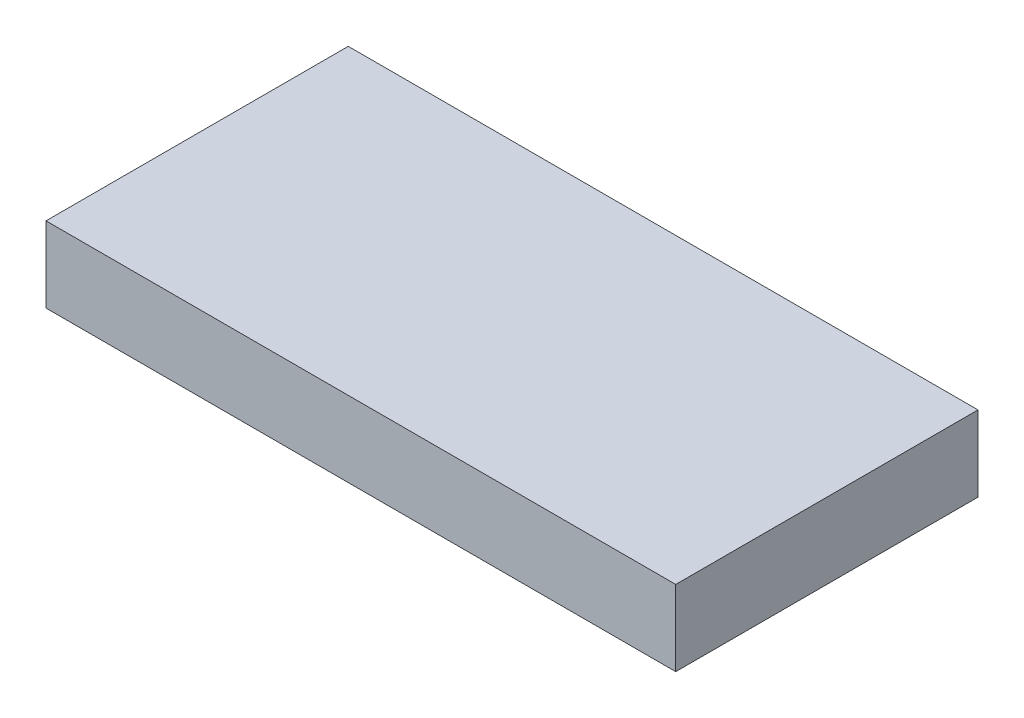
ISO-10303-21;
HEADER;
FILE_DESCRIPTION(('STEP AP214'),'2;1');
FILE_NAME('part.step','',(''),(''),'','','');
FILE_SCHEMA(('AUTOMOTIVE_DESIGN { 1 0 10303 214 1 1 1 1 }'));
ENDSEC;
DATA;
#1=APPLICATION_CONTEXT('core data for automotive mechanical design processes');
#2=APPLICATION_PROTOCOL_DEFINITION('international standard','automotive_design',2000,#1);
#3=PRODUCT_CONTEXT('',#1,'mechanical');
#4=PRODUCT('Part','Part','',(#3));
#5=PRODUCT_RELATED_PRODUCT_CATEGORY('part','',(#4));
#6=PRODUCT_DEFINITION_FORMATION('','',#4);
#7=PRODUCT_DEFINITION_CONTEXT('part definition',#1,'design');
#8=PRODUCT_DEFINITION('design','',#6,#7);
#9=PRODUCT_DEFINITION_SHAPE('','',#8);
#10=(LENGTH_UNIT() NAMED_UNIT(*) SI_UNIT(.MILLI.,.METRE.));
#11=(NAMED_UNIT(*) PLANE_ANGLE_UNIT() SI_UNIT($,.RADIAN.));
#12=(NAMED_UNIT(*) SI_UNIT($,.STERADIAN.) SOLID_ANGLE_UNIT());
#13=UNCERTAINTY_MEASURE_WITH_UNIT(LENGTH_MEASURE(1.E-05),#10,'distance_accuracy_value','');
#14=(GEOMETRIC_REPRESENTATION_CONTEXT(3) GLOBAL_UNCERTAINTY_ASSIGNED_CONTEXT((#13)) GLOBAL_UNIT_ASSIGNED_CONTEXT((#10,
#11,#12)) REPRESENTATION_CONTEXT('',''));
#15=CARTESIAN_POINT('',(0.,0.,0.));
#16=DIRECTION('',(0.,0.,1.));
#17=DIRECTION('',(1.,0.,0.));
#18=AXIS2_PLACEMENT_3D('',#15,#16,#17);
#19=CARTESIAN_POINT('',(-125.,30.,-59.9999999999998));
#20=DIRECTION('',(1.,0.,0.));
#21=DIRECTION('',(0.,0.,-1.));
#22=AXIS2_PLACEMENT_3D('',#19,#20,#21);
#23=PLANE('',#22);
#24=DIRECTION('',(0.,0.,1.));
#25=VECTOR('',#24,1.);
#26=CARTESIAN_POINT('',(-125.,0.,-59.9999999999998));
#27=LINE('',#26,#25);
#28=CARTESIAN_POINT('',(-125.,0.,-59.9999999999998));
#29=VERTEX_POINT('',#28);
#30=CARTESIAN_POINT('',(-125.,0.,60.0000000000002));
#31=VERTEX_POINT('',#30);
#32=EDGE_CURVE('E111',#29,#31,#27,.T.);
#33=ORIENTED_EDGE('',*,*,#32,.T.);
#34=DIRECTION('',(0.,-1.,0.));
#35=VECTOR('',#34,1.);
#36=CARTESIAN_POINT('',(-125.,30.,60.0000000000002));
#37=LINE('',#36,#35);
#38=CARTESIAN_POINT('',(-125.,30.,60.0000000000002));
#39=VERTEX_POINT('',#38);
#40=EDGE_CURVE('E11',#39,#31,#37,.T.);
#41=ORIENTED_EDGE('',*,*,#40,.F.);
#42=DIRECTION('',(0.,0.,1.));
#43=VECTOR('',#42,1.);
#44=CARTESIAN_POINT('',(-125.,30.,-59.9999999999998));
#45=LINE('',#44,#43);
#46=CARTESIAN_POINT('',(-125.,30.,-59.9999999999998));
#47=VERTEX_POINT('',#46);
#48=EDGE_CURVE('E95',#47,#39,#45,.T.);
#49=ORIENTED_EDGE('',*,*,#48,.F.);
#50=DIRECTION('',(0.,-1.,0.));
#51=VECTOR('',#50,1.);
#52=CARTESIAN_POINT('',(-125.,30.,-59.9999999999998));
#53=LINE('',#52,#51);
#54=EDGE_CURVE('E107',#47,#29,#53,.T.);
#55=ORIENTED_EDGE('',*,*,#54,.T.);
#56=EDGE_LOOP('',(#33,#41,#49,#55));
#57=FACE_BOUND('',#56,.T.);
#58=ADVANCED_FACE('F43',(#57),#23,.F.);
#59=CARTESIAN_POINT('',(125.,30.,60.0000000000002));
#60=DIRECTION('',(0.,0.,-1.));
#61=DIRECTION('',(-1.,0.,0.));
#62=AXIS2_PLACEMENT_3D('',#59,#60,#61);
#63=PLANE('',#62);
#64=DIRECTION('',(1.,0.,0.));
#65=VECTOR('',#64,1.);
#66=CARTESIAN_POINT('',(125.,0.,60.0000000000002));
#67=LINE('',#66,#65);
#68=CARTESIAN_POINT('',(125.,0.,60.0000000000002));
#69=VERTEX_POINT('',#68);
#70=EDGE_CURVE('E100',#31,#69,#67,.T.);
#71=ORIENTED_EDGE('',*,*,#70,.T.);
#72=DIRECTION('',(0.,-1.,0.));
#73=VECTOR('',#72,1.);
#74=CARTESIAN_POINT('',(125.,30.,60.0000000000002));
#75=LINE('',#74,#73);
#76=CARTESIAN_POINT('',(125.,30.,60.0000000000002));
#77=VERTEX_POINT('',#76);
#78=EDGE_CURVE('E52',#77,#69,#75,.T.);
#79=ORIENTED_EDGE('',*,*,#78,.F.);
#80=DIRECTION('',(1.,0.,0.));
#81=VECTOR('',#80,1.);
#82=CARTESIAN_POINT('',(125.,30.,60.0000000000002));
#83=LINE('',#82,#81);
#84=EDGE_CURVE('E90',#39,#77,#83,.T.);
#85=ORIENTED_EDGE('',*,*,#84,.F.);
#86=ORIENTED_EDGE('',*,*,#40,.T.);
#87=EDGE_LOOP('',(#71,#79,#85,#86));
#88=FACE_BOUND('',#87,.T.);
#89=ADVANCED_FACE('F99',(#88),#63,.F.);
#90=CARTESIAN_POINT('',(125.,30.,-59.9999999999998));
#91=DIRECTION('',(-1.,0.,0.));
#92=DIRECTION('',(0.,0.,1.));
#93=AXIS2_PLACEMENT_3D('',#90,#91,#92);
#94=PLANE('',#93);
#95=DIRECTION('',(0.,0.,-1.));
#96=VECTOR('',#95,1.);
#97=CARTESIAN_POINT('',(125.,0.,-59.9999999999998));
#98=LINE('',#97,#96);
#99=CARTESIAN_POINT('',(125.,0.,-59.9999999999998));
#100=VERTEX_POINT('',#99);
#101=EDGE_CURVE('E77',#69,#100,#98,.T.);
#102=ORIENTED_EDGE('',*,*,#101,.T.);
#103=DIRECTION('',(0.,-1.,0.));
#104=VECTOR('',#103,1.);
#105=CARTESIAN_POINT('',(125.,30.,-59.9999999999998));
#106=LINE('',#105,#104);
#107=CARTESIAN_POINT('',(125.,30.,-59.9999999999998));
#108=VERTEX_POINT('',#107);
#109=EDGE_CURVE('E102',#108,#100,#106,.T.);
#110=ORIENTED_EDGE('',*,*,#109,.F.);
#111=DIRECTION('',(0.,0.,-1.));
#112=VECTOR('',#111,1.);
#113=CARTESIAN_POINT('',(125.,30.,-59.9999999999998));
#114=LINE('',#113,#112);
#115=EDGE_CURVE('E93',#77,#108,#114,.T.);
#116=ORIENTED_EDGE('',*,*,#115,.F.);
#117=ORIENTED_EDGE('',*,*,#78,.T.);
#118=EDGE_LOOP('',(#102,#110,#116,#117));
#119=FACE_BOUND('',#118,.T.);
#120=ADVANCED_FACE('F103',(#119),#94,.F.);
#121=CARTESIAN_POINT('',(125.,30.,-59.9999999999998));
#122=DIRECTION('',(0.,0.,1.));
#123=DIRECTION('',(1.,0.,0.));
#124=AXIS2_PLACEMENT_3D('',#121,#122,#123);
#125=PLANE('',#124);
#126=DIRECTION('',(-1.,0.,0.));
#127=VECTOR('',#126,1.);
#128=CARTESIAN_POINT('',(125.,0.,-59.9999999999998));
#129=LINE('',#128,#127);
#130=EDGE_CURVE('E83',#100,#29,#129,.T.);
#131=ORIENTED_EDGE('',*,*,#130,.T.);
#132=ORIENTED_EDGE('',*,*,#54,.F.);
#133=DIRECTION('',(-1.,0.,0.));
#134=VECTOR('',#133,1.);
#135=CARTESIAN_POINT('',(125.,30.,-59.9999999999998));
#136=LINE('',#135,#134);
#137=EDGE_CURVE('E60',#108,#47,#136,.T.);
#138=ORIENTED_EDGE('',*,*,#137,.F.);
#139=ORIENTED_EDGE('',*,*,#109,.T.);
#140=EDGE_LOOP('',(#131,#132,#138,#139));
#141=FACE_BOUND('',#140,.T.);
#142=ADVANCED_FACE('F124',(#141),#125,.F.);
#143=CARTESIAN_POINT('',(0.,30.,0.));
#144=DIRECTION('',(0.,-1.,0.));
#145=DIRECTION('',(0.,0.,-1.));
#146=AXIS2_PLACEMENT_3D('',#143,#144,#145);
#147=PLANE('',#146);
#148=ORIENTED_EDGE('',*,*,#48,.T.);
#149=ORIENTED_EDGE('',*,*,#84,.T.);
#150=ORIENTED_EDGE('',*,*,#115,.T.);
#151=ORIENTED_EDGE('',*,*,#137,.T.);
#152=EDGE_LOOP('',(#148,#149,#150,#151));
#153=FACE_BOUND('',#152,.T.);
#154=ADVANCED_FACE('F91',(#153),#147,.F.);
#155=CARTESIAN_POINT('',(0.,0.,0.));
#156=DIRECTION('',(0.,-1.,0.));
#157=DIRECTION('',(0.,0.,-1.));
#158=AXIS2_PLACEMENT_3D('',#155,#156,#157);
#159=PLANE('',#158);
#160=ORIENTED_EDGE('',*,*,#32,.F.);
#161=ORIENTED_EDGE('',*,*,#130,.F.);
#162=ORIENTED_EDGE('',*,*,#101,.F.);
#163=ORIENTED_EDGE('',*,*,#70,.F.);
#164=EDGE_LOOP('',(#160,#161,#162,#163));
#165=FACE_BOUND('',#164,.T.);
#166=ADVANCED_FACE('F127',(#165),#159,.T.);
#167=CLOSED_SHELL('',(#58,#89,#120,#142,#154,#166));
#168=MANIFOLD_SOLID_BREP('B2',#167);
#169=ADVANCED_BREP_SHAPE_REPRESENTATION('',(#18,#168),#14);
#170=SHAPE_DEFINITION_REPRESENTATION(#9,#169);
ENDSEC;
END-ISO-10303-21;
